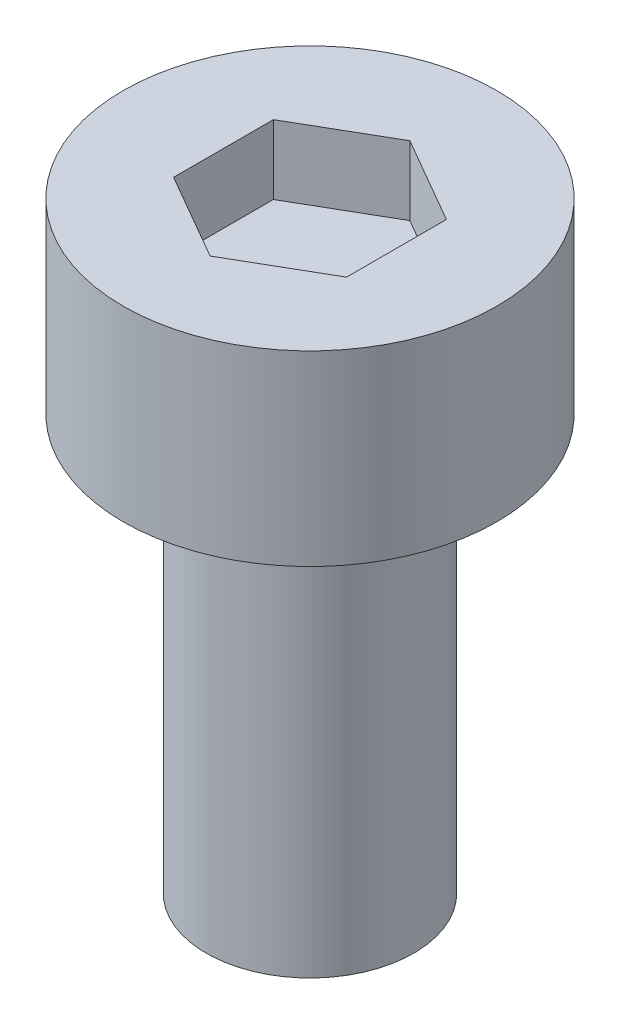
ISO-10303-21;
HEADER;
FILE_DESCRIPTION(('STEP AP214'),'2;1');
FILE_NAME('part.step','',(''),(''),'','','');
FILE_SCHEMA(('AUTOMOTIVE_DESIGN { 1 0 10303 214 1 1 1 1 }'));
ENDSEC;
DATA;
#1=APPLICATION_CONTEXT('core data for automotive mechanical design processes');
#2=APPLICATION_PROTOCOL_DEFINITION('international standard','automotive_design',2000,#1);
#3=PRODUCT_CONTEXT('',#1,'mechanical');
#4=PRODUCT('Part','Part','',(#3));
#5=PRODUCT_RELATED_PRODUCT_CATEGORY('part','',(#4));
#6=PRODUCT_DEFINITION_FORMATION('','',#4);
#7=PRODUCT_DEFINITION_CONTEXT('part definition',#1,'design');
#8=PRODUCT_DEFINITION('design','',#6,#7);
#9=PRODUCT_DEFINITION_SHAPE('','',#8);
#10=(LENGTH_UNIT() NAMED_UNIT(*) SI_UNIT(.MILLI.,.METRE.));
#11=(NAMED_UNIT(*) PLANE_ANGLE_UNIT() SI_UNIT($,.RADIAN.));
#12=(NAMED_UNIT(*) SI_UNIT($,.STERADIAN.) SOLID_ANGLE_UNIT());
#13=UNCERTAINTY_MEASURE_WITH_UNIT(LENGTH_MEASURE(1.E-05),#10,'distance_accuracy_value','');
#14=(GEOMETRIC_REPRESENTATION_CONTEXT(3) GLOBAL_UNCERTAINTY_ASSIGNED_CONTEXT((#13)) GLOBAL_UNIT_ASSIGNED_CONTEXT((#10,
#11,#12)) REPRESENTATION_CONTEXT('',''));
#15=CARTESIAN_POINT('',(0.,0.,0.));
#16=DIRECTION('',(0.,0.,1.));
#17=DIRECTION('',(1.,0.,0.));
#18=AXIS2_PLACEMENT_3D('',#15,#16,#17);
#19=CARTESIAN_POINT('',(0.,2.7,0.));
#20=DIRECTION('',(0.,-1.,0.));
#21=DIRECTION('',(0.,0.,-1.));
#22=AXIS2_PLACEMENT_3D('',#19,#20,#21);
#23=CYLINDRICAL_SURFACE('',#22,2.7);
#24=CARTESIAN_POINT('',(0.,2.7,0.));
#25=DIRECTION('',(0.,1.,0.));
#26=DIRECTION('',(0.,0.,1.));
#27=AXIS2_PLACEMENT_3D('',#24,#25,#26);
#28=CIRCLE('',#27,2.7);
#29=CARTESIAN_POINT('',(0.,2.7,2.7));
#30=VERTEX_POINT('',#29);
#31=EDGE_CURVE('E45',#30,#30,#28,.T.);
#32=ORIENTED_EDGE('',*,*,#31,.F.);
#33=EDGE_LOOP('',(#32));
#34=FACE_BOUND('',#33,.T.);
#35=CARTESIAN_POINT('',(0.,0.,0.));
#36=DIRECTION('',(0.,1.,0.));
#37=DIRECTION('',(0.,0.,1.));
#38=AXIS2_PLACEMENT_3D('',#35,#36,#37);
#39=CIRCLE('',#38,2.7);
#40=CARTESIAN_POINT('',(0.,0.,2.7));
#41=VERTEX_POINT('',#40);
#42=EDGE_CURVE('E40',#41,#41,#39,.T.);
#43=ORIENTED_EDGE('',*,*,#42,.T.);
#44=EDGE_LOOP('',(#43));
#45=FACE_BOUND('',#44,.T.);
#46=ADVANCED_FACE('F37',(#34,#45),#23,.T.);
#47=CARTESIAN_POINT('',(0.,2.7,0.));
#48=DIRECTION('',(0.,1.,0.));
#49=DIRECTION('',(0.,0.,1.));
#50=AXIS2_PLACEMENT_3D('',#47,#48,#49);
#51=PLANE('',#50);
#52=DIRECTION('',(-0.866025403784439,0.,-0.5));
#53=VECTOR('',#52,1.);
#54=CARTESIAN_POINT('',(1.25,2.7,-0.721687836487033));
#55=LINE('',#54,#53);
#56=CARTESIAN_POINT('',(1.25,2.7,-0.721687836487033));
#57=VERTEX_POINT('',#56);
#58=CARTESIAN_POINT('',(0.,2.7,-1.44337567297407));
#59=VERTEX_POINT('',#58);
#60=EDGE_CURVE('E53',#57,#59,#55,.T.);
#61=ORIENTED_EDGE('',*,*,#60,.F.);
#62=DIRECTION('',(0.,0.,-1.));
#63=VECTOR('',#62,1.);
#64=CARTESIAN_POINT('',(1.25,2.7,0.721687836487031));
#65=LINE('',#64,#63);
#66=CARTESIAN_POINT('',(1.25,2.7,0.721687836487031));
#67=VERTEX_POINT('',#66);
#68=EDGE_CURVE('E137',#67,#57,#65,.T.);
#69=ORIENTED_EDGE('',*,*,#68,.F.);
#70=DIRECTION('',(0.866025403784439,0.,-0.5));
#71=VECTOR('',#70,1.);
#72=CARTESIAN_POINT('',(0.,2.7,1.44337567297406));
#73=LINE('',#72,#71);
#74=CARTESIAN_POINT('',(0.,2.7,1.44337567297406));
#75=VERTEX_POINT('',#74);
#76=EDGE_CURVE('E135',#75,#67,#73,.T.);
#77=ORIENTED_EDGE('',*,*,#76,.F.);
#78=DIRECTION('',(0.866025403784438,0.,0.5));
#79=VECTOR('',#78,1.);
#80=CARTESIAN_POINT('',(-1.25,2.7,0.721687836487032));
#81=LINE('',#80,#79);
#82=CARTESIAN_POINT('',(-1.25,2.7,0.721687836487032));
#83=VERTEX_POINT('',#82);
#84=EDGE_CURVE('E101',#83,#75,#81,.T.);
#85=ORIENTED_EDGE('',*,*,#84,.F.);
#86=DIRECTION('',(0.,0.,1.));
#87=VECTOR('',#86,1.);
#88=CARTESIAN_POINT('',(-1.25,2.7,-0.721687836487032));
#89=LINE('',#88,#87);
#90=CARTESIAN_POINT('',(-1.25,2.7,-0.721687836487032));
#91=VERTEX_POINT('',#90);
#92=EDGE_CURVE('E131',#91,#83,#89,.T.);
#93=ORIENTED_EDGE('',*,*,#92,.F.);
#94=DIRECTION('',(-0.866025403784439,0.,0.5));
#95=VECTOR('',#94,1.);
#96=CARTESIAN_POINT('',(0.,2.7,-1.44337567297407));
#97=LINE('',#96,#95);
#98=EDGE_CURVE('E127',#59,#91,#97,.T.);
#99=ORIENTED_EDGE('',*,*,#98,.F.);
#100=EDGE_LOOP('',(#61,#69,#77,#85,#93,#99));
#101=FACE_BOUND('',#100,.T.);
#102=ORIENTED_EDGE('',*,*,#31,.T.);
#103=EDGE_LOOP('',(#102));
#104=FACE_BOUND('',#103,.T.);
#105=ADVANCED_FACE('F155',(#101,#104),#51,.T.);
#106=CARTESIAN_POINT('',(0.,0.,0.));
#107=DIRECTION('',(0.,1.,0.));
#108=DIRECTION('',(0.,0.,1.));
#109=AXIS2_PLACEMENT_3D('',#106,#107,#108);
#110=PLANE('',#109);
#111=CARTESIAN_POINT('',(0.,0.,0.));
#112=DIRECTION('',(0.,-1.,0.));
#113=DIRECTION('',(0.,0.,-1.));
#114=AXIS2_PLACEMENT_3D('',#111,#112,#113);
#115=CIRCLE('',#114,1.5);
#116=CARTESIAN_POINT('',(0.,0.,-1.5));
#117=VERTEX_POINT('',#116);
#118=EDGE_CURVE('E11',#117,#117,#115,.T.);
#119=ORIENTED_EDGE('',*,*,#118,.F.);
#120=EDGE_LOOP('',(#119));
#121=FACE_BOUND('',#120,.T.);
#122=ORIENTED_EDGE('',*,*,#42,.F.);
#123=EDGE_LOOP('',(#122));
#124=FACE_BOUND('',#123,.T.);
#125=ADVANCED_FACE('F152',(#121,#124),#110,.F.);
#126=CARTESIAN_POINT('',(1.25,1.7,-0.721687836487033));
#127=DIRECTION('',(0.5,0.,-0.866025403784439));
#128=DIRECTION('',(-0.866025403784439,0.,-0.5));
#129=AXIS2_PLACEMENT_3D('',#126,#127,#128);
#130=PLANE('',#129);
#131=ORIENTED_EDGE('',*,*,#60,.T.);
#132=DIRECTION('',(0.,1.,0.));
#133=VECTOR('',#132,1.);
#134=CARTESIAN_POINT('',(0.,1.7,-1.44337567297407));
#135=LINE('',#134,#133);
#136=CARTESIAN_POINT('',(0.,1.7,-1.44337567297407));
#137=VERTEX_POINT('',#136);
#138=EDGE_CURVE('E83',#137,#59,#135,.T.);
#139=ORIENTED_EDGE('',*,*,#138,.F.);
#140=DIRECTION('',(-0.866025403784439,0.,-0.5));
#141=VECTOR('',#140,1.);
#142=CARTESIAN_POINT('',(1.25,1.7,-0.721687836487033));
#143=LINE('',#142,#141);
#144=CARTESIAN_POINT('',(1.25,1.7,-0.721687836487033));
#145=VERTEX_POINT('',#144);
#146=EDGE_CURVE('E139',#145,#137,#143,.T.);
#147=ORIENTED_EDGE('',*,*,#146,.F.);
#148=DIRECTION('',(0.,1.,0.));
#149=VECTOR('',#148,1.);
#150=CARTESIAN_POINT('',(1.25,1.7,-0.721687836487033));
#151=LINE('',#150,#149);
#152=EDGE_CURVE('E61',#145,#57,#151,.T.);
#153=ORIENTED_EDGE('',*,*,#152,.T.);
#154=EDGE_LOOP('',(#131,#139,#147,#153));
#155=FACE_BOUND('',#154,.T.);
#156=ADVANCED_FACE('F154',(#155),#130,.F.);
#157=CARTESIAN_POINT('',(1.25,1.7,0.721687836487031));
#158=DIRECTION('',(1.,0.,0.));
#159=DIRECTION('',(0.,0.,-1.));
#160=AXIS2_PLACEMENT_3D('',#157,#158,#159);
#161=PLANE('',#160);
#162=ORIENTED_EDGE('',*,*,#68,.T.);
#163=ORIENTED_EDGE('',*,*,#152,.F.);
#164=DIRECTION('',(0.,0.,-1.));
#165=VECTOR('',#164,1.);
#166=CARTESIAN_POINT('',(1.25,1.7,0.721687836487031));
#167=LINE('',#166,#165);
#168=CARTESIAN_POINT('',(1.25,1.7,0.721687836487031));
#169=VERTEX_POINT('',#168);
#170=EDGE_CURVE('E113',#169,#145,#167,.T.);
#171=ORIENTED_EDGE('',*,*,#170,.F.);
#172=DIRECTION('',(0.,1.,0.));
#173=VECTOR('',#172,1.);
#174=CARTESIAN_POINT('',(1.25,1.7,0.721687836487031));
#175=LINE('',#174,#173);
#176=EDGE_CURVE('E105',#169,#67,#175,.T.);
#177=ORIENTED_EDGE('',*,*,#176,.T.);
#178=EDGE_LOOP('',(#162,#163,#171,#177));
#179=FACE_BOUND('',#178,.T.);
#180=ADVANCED_FACE('F161',(#179),#161,.F.);
#181=CARTESIAN_POINT('',(0.,1.7,1.44337567297406));
#182=DIRECTION('',(0.5,0.,0.866025403784439));
#183=DIRECTION('',(0.866025403784439,0.,-0.5));
#184=AXIS2_PLACEMENT_3D('',#181,#182,#183);
#185=PLANE('',#184);
#186=ORIENTED_EDGE('',*,*,#76,.T.);
#187=ORIENTED_EDGE('',*,*,#176,.F.);
#188=DIRECTION('',(0.866025403784439,0.,-0.5));
#189=VECTOR('',#188,1.);
#190=CARTESIAN_POINT('',(0.,1.7,1.44337567297406));
#191=LINE('',#190,#189);
#192=CARTESIAN_POINT('',(0.,1.7,1.44337567297406));
#193=VERTEX_POINT('',#192);
#194=EDGE_CURVE('E109',#193,#169,#191,.T.);
#195=ORIENTED_EDGE('',*,*,#194,.F.);
#196=DIRECTION('',(0.,1.,0.));
#197=VECTOR('',#196,1.);
#198=CARTESIAN_POINT('',(0.,1.7,1.44337567297406));
#199=LINE('',#198,#197);
#200=EDGE_CURVE('E94',#193,#75,#199,.T.);
#201=ORIENTED_EDGE('',*,*,#200,.T.);
#202=EDGE_LOOP('',(#186,#187,#195,#201));
#203=FACE_BOUND('',#202,.T.);
#204=ADVANCED_FACE('F110',(#203),#185,.F.);
#205=CARTESIAN_POINT('',(-1.25,1.7,0.721687836487032));
#206=DIRECTION('',(-0.5,0.,0.866025403784438));
#207=DIRECTION('',(0.866025403784438,0.,0.5));
#208=AXIS2_PLACEMENT_3D('',#205,#206,#207);
#209=PLANE('',#208);
#210=ORIENTED_EDGE('',*,*,#84,.T.);
#211=ORIENTED_EDGE('',*,*,#200,.F.);
#212=DIRECTION('',(0.866025403784438,0.,0.5));
#213=VECTOR('',#212,1.);
#214=CARTESIAN_POINT('',(-1.25,1.7,0.721687836487032));
#215=LINE('',#214,#213);
#216=CARTESIAN_POINT('',(-1.25,1.7,0.721687836487032));
#217=VERTEX_POINT('',#216);
#218=EDGE_CURVE('E98',#217,#193,#215,.T.);
#219=ORIENTED_EDGE('',*,*,#218,.F.);
#220=DIRECTION('',(0.,1.,0.));
#221=VECTOR('',#220,1.);
#222=CARTESIAN_POINT('',(-1.25,1.7,0.721687836487032));
#223=LINE('',#222,#221);
#224=EDGE_CURVE('E106',#217,#83,#223,.T.);
#225=ORIENTED_EDGE('',*,*,#224,.T.);
#226=EDGE_LOOP('',(#210,#211,#219,#225));
#227=FACE_BOUND('',#226,.T.);
#228=ADVANCED_FACE('F96',(#227),#209,.F.);
#229=CARTESIAN_POINT('',(-1.25,1.7,-0.721687836487032));
#230=DIRECTION('',(-1.,0.,0.));
#231=DIRECTION('',(0.,0.,1.));
#232=AXIS2_PLACEMENT_3D('',#229,#230,#231);
#233=PLANE('',#232);
#234=ORIENTED_EDGE('',*,*,#92,.T.);
#235=ORIENTED_EDGE('',*,*,#224,.F.);
#236=DIRECTION('',(0.,0.,1.));
#237=VECTOR('',#236,1.);
#238=CARTESIAN_POINT('',(-1.25,1.7,-0.721687836487032));
#239=LINE('',#238,#237);
#240=CARTESIAN_POINT('',(-1.25,1.7,-0.721687836487032));
#241=VERTEX_POINT('',#240);
#242=EDGE_CURVE('E119',#241,#217,#239,.T.);
#243=ORIENTED_EDGE('',*,*,#242,.F.);
#244=DIRECTION('',(0.,1.,0.));
#245=VECTOR('',#244,1.);
#246=CARTESIAN_POINT('',(-1.25,1.7,-0.721687836487032));
#247=LINE('',#246,#245);
#248=EDGE_CURVE('E143',#241,#91,#247,.T.);
#249=ORIENTED_EDGE('',*,*,#248,.T.);
#250=EDGE_LOOP('',(#234,#235,#243,#249));
#251=FACE_BOUND('',#250,.T.);
#252=ADVANCED_FACE('F210',(#251),#233,.F.);
#253=CARTESIAN_POINT('',(0.,1.7,-1.44337567297407));
#254=DIRECTION('',(-0.5,0.,-0.866025403784439));
#255=DIRECTION('',(-0.866025403784439,0.,0.5));
#256=AXIS2_PLACEMENT_3D('',#253,#254,#255);
#257=PLANE('',#256);
#258=ORIENTED_EDGE('',*,*,#98,.T.);
#259=ORIENTED_EDGE('',*,*,#248,.F.);
#260=DIRECTION('',(-0.866025403784439,0.,0.5));
#261=VECTOR('',#260,1.);
#262=CARTESIAN_POINT('',(0.,1.7,-1.44337567297407));
#263=LINE('',#262,#261);
#264=EDGE_CURVE('E121',#137,#241,#263,.T.);
#265=ORIENTED_EDGE('',*,*,#264,.F.);
#266=ORIENTED_EDGE('',*,*,#138,.T.);
#267=EDGE_LOOP('',(#258,#259,#265,#266));
#268=FACE_BOUND('',#267,.T.);
#269=ADVANCED_FACE('F220',(#268),#257,.F.);
#270=CARTESIAN_POINT('',(0.,1.7,0.));
#271=DIRECTION('',(0.,1.,0.));
#272=DIRECTION('',(0.,0.,1.));
#273=AXIS2_PLACEMENT_3D('',#270,#271,#272);
#274=PLANE('',#273);
#275=ORIENTED_EDGE('',*,*,#146,.T.);
#276=ORIENTED_EDGE('',*,*,#264,.T.);
#277=ORIENTED_EDGE('',*,*,#242,.T.);
#278=ORIENTED_EDGE('',*,*,#218,.T.);
#279=ORIENTED_EDGE('',*,*,#194,.T.);
#280=ORIENTED_EDGE('',*,*,#170,.T.);
#281=EDGE_LOOP('',(#275,#276,#277,#278,#279,#280));
#282=FACE_BOUND('',#281,.T.);
#283=ADVANCED_FACE('F116',(#282),#274,.T.);
#284=CARTESIAN_POINT('',(0.,-6.,0.));
#285=DIRECTION('',(0.,1.,0.));
#286=DIRECTION('',(0.,0.,1.));
#287=AXIS2_PLACEMENT_3D('',#284,#285,#286);
#288=CYLINDRICAL_SURFACE('',#287,1.5);
#289=CARTESIAN_POINT('',(0.,-6.,0.));
#290=DIRECTION('',(0.,-1.,0.));
#291=DIRECTION('',(0.,0.,-1.));
#292=AXIS2_PLACEMENT_3D('',#289,#290,#291);
#293=CIRCLE('',#292,1.5);
#294=CARTESIAN_POINT('',(0.,-6.,-1.5));
#295=VERTEX_POINT('',#294);
#296=EDGE_CURVE('E128',#295,#295,#293,.T.);
#297=ORIENTED_EDGE('',*,*,#296,.F.);
#298=EDGE_LOOP('',(#297));
#299=FACE_BOUND('',#298,.T.);
#300=ORIENTED_EDGE('',*,*,#118,.T.);
#301=EDGE_LOOP('',(#300));
#302=FACE_BOUND('',#301,.T.);
#303=ADVANCED_FACE('F240',(#299,#302),#288,.T.);
#304=CARTESIAN_POINT('',(0.,-6.,0.));
#305=DIRECTION('',(0.,-1.,0.));
#306=DIRECTION('',(0.,0.,-1.));
#307=AXIS2_PLACEMENT_3D('',#304,#305,#306);
#308=PLANE('',#307);
#309=ORIENTED_EDGE('',*,*,#296,.T.);
#310=EDGE_LOOP('',(#309));
#311=FACE_BOUND('',#310,.T.);
#312=ADVANCED_FACE('F255',(#311),#308,.T.);
#313=CLOSED_SHELL('',(#46,#105,#125,#156,#180,#204,#228,#252,#269,#283,#303,#312));
#314=MANIFOLD_SOLID_BREP('B2',#313);
#315=ADVANCED_BREP_SHAPE_REPRESENTATION('',(#18,#314),#14);
#316=SHAPE_DEFINITION_REPRESENTATION(#9,#315);
ENDSEC;
END-ISO-10303-21;
